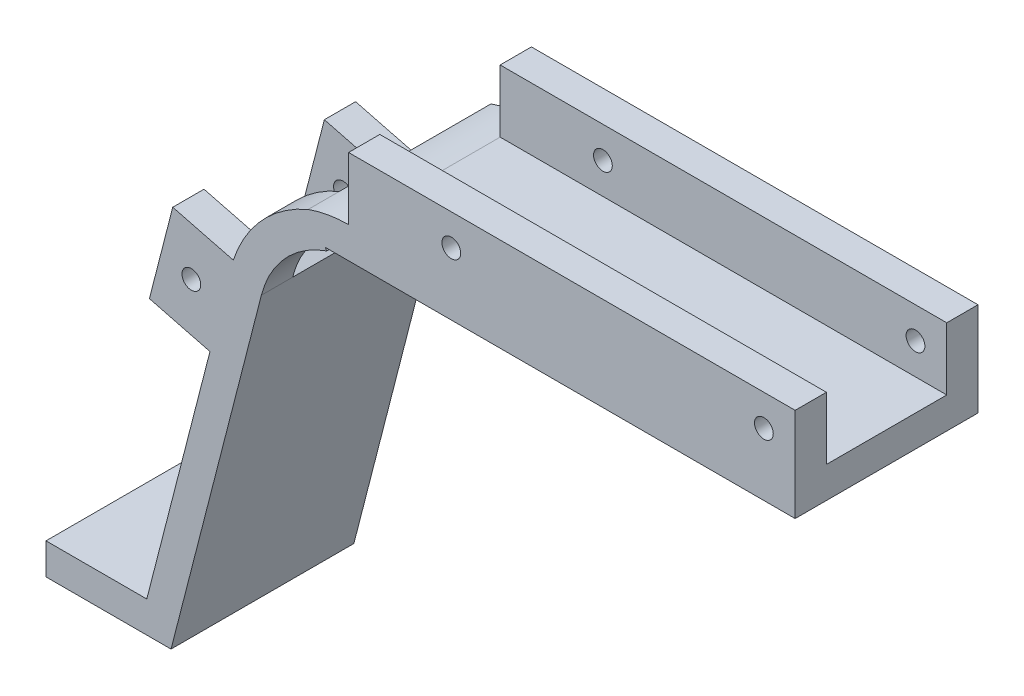
ISO-10303-21;
HEADER;
FILE_DESCRIPTION(('STEP AP214'),'2;1');
FILE_NAME('part.step','',(''),(''),'','','');
FILE_SCHEMA(('AUTOMOTIVE_DESIGN { 1 0 10303 214 1 1 1 1 }'));
ENDSEC;
DATA;
#1=APPLICATION_CONTEXT('core data for automotive mechanical design processes');
#2=APPLICATION_PROTOCOL_DEFINITION('international standard','automotive_design',2000,#1);
#3=PRODUCT_CONTEXT('',#1,'mechanical');
#4=PRODUCT('Part','Part','',(#3));
#5=PRODUCT_RELATED_PRODUCT_CATEGORY('part','',(#4));
#6=PRODUCT_DEFINITION_FORMATION('','',#4);
#7=PRODUCT_DEFINITION_CONTEXT('part definition',#1,'design');
#8=PRODUCT_DEFINITION('design','',#6,#7);
#9=PRODUCT_DEFINITION_SHAPE('','',#8);
#10=(LENGTH_UNIT() NAMED_UNIT(*) SI_UNIT(.MILLI.,.METRE.));
#11=(NAMED_UNIT(*) PLANE_ANGLE_UNIT() SI_UNIT($,.RADIAN.));
#12=(NAMED_UNIT(*) SI_UNIT($,.STERADIAN.) SOLID_ANGLE_UNIT());
#13=UNCERTAINTY_MEASURE_WITH_UNIT(LENGTH_MEASURE(1.E-05),#10,'distance_accuracy_value','');
#14=(GEOMETRIC_REPRESENTATION_CONTEXT(3) GLOBAL_UNCERTAINTY_ASSIGNED_CONTEXT((#13)) GLOBAL_UNIT_ASSIGNED_CONTEXT((#10,
#11,#12)) REPRESENTATION_CONTEXT('',''));
#15=CARTESIAN_POINT('',(0.,0.,0.));
#16=DIRECTION('',(0.,0.,1.));
#17=DIRECTION('',(1.,0.,0.));
#18=AXIS2_PLACEMENT_3D('',#15,#16,#17);
#19=CARTESIAN_POINT('',(30.0716443930858,58.6603082817505,-5.));
#20=DIRECTION('',(0.968542433750036,-0.248848455943689,0.));
#21=DIRECTION('',(0.248848455943689,0.968542433750036,0.));
#22=AXIS2_PLACEMENT_3D('',#19,#20,#21);
#23=PLANE('',#22);
#24=DIRECTION('',(0.,0.,1.));
#25=VECTOR('',#24,1.);
#26=CARTESIAN_POINT('',(26.3912089750386,44.3356950807672,-29.25));
#27=LINE('',#26,#25);
#28=CARTESIAN_POINT('',(26.3912089750386,44.3356950807672,-29.25));
#29=VERTEX_POINT('',#28);
#30=CARTESIAN_POINT('',(26.3912089750386,44.3356950807672,-24.25));
#31=VERTEX_POINT('',#30);
#32=EDGE_CURVE('E847',#29,#31,#27,.T.);
#33=ORIENTED_EDGE('',*,*,#32,.F.);
#34=DIRECTION('',(0.248848455943689,0.968542433750035,0.));
#35=VECTOR('',#34,1.);
#36=CARTESIAN_POINT('',(15.,0.,-29.25));
#37=LINE('',#36,#35);
#38=CARTESIAN_POINT('',(16.2846543799851,5.,-29.25));
#39=VERTEX_POINT('',#38);
#40=EDGE_CURVE('E237',#39,#29,#37,.T.);
#41=ORIENTED_EDGE('',*,*,#40,.F.);
#42=DIRECTION('',(0.,0.,1.));
#43=VECTOR('',#42,1.);
#44=CARTESIAN_POINT('',(16.2846543799851,5.,-5.));
#45=LINE('',#44,#43);
#46=CARTESIAN_POINT('',(16.2846543799851,5.,0.));
#47=VERTEX_POINT('',#46);
#48=EDGE_CURVE('E388',#39,#47,#45,.T.);
#49=ORIENTED_EDGE('',*,*,#48,.T.);
#50=DIRECTION('',(0.248848455943689,0.968542433750035,0.));
#51=VECTOR('',#50,1.);
#52=CARTESIAN_POINT('',(15.,0.,0.));
#53=LINE('',#52,#51);
#54=CARTESIAN_POINT('',(26.3912089750386,44.3356950807672,0.));
#55=VERTEX_POINT('',#54);
#56=EDGE_CURVE('E403',#47,#55,#53,.T.);
#57=ORIENTED_EDGE('',*,*,#56,.T.);
#58=DIRECTION('',(0.,0.,1.));
#59=VECTOR('',#58,1.);
#60=CARTESIAN_POINT('',(26.3912089750386,44.3356950807672,-5.));
#61=LINE('',#60,#59);
#62=CARTESIAN_POINT('',(26.3912089750386,44.3356950807672,-5.));
#63=VERTEX_POINT('',#62);
#64=EDGE_CURVE('E51',#63,#55,#61,.T.);
#65=ORIENTED_EDGE('',*,*,#64,.F.);
#66=DIRECTION('',(-0.248848455943689,-0.968542433750035,0.));
#67=VECTOR('',#66,1.);
#68=CARTESIAN_POINT('',(30.1238545546568,58.8635153169826,-5.));
#69=LINE('',#68,#67);
#70=CARTESIAN_POINT('',(30.1238545546567,58.8635153169826,-5.));
#71=VERTEX_POINT('',#70);
#72=EDGE_CURVE('E56',#71,#63,#69,.T.);
#73=ORIENTED_EDGE('',*,*,#72,.F.);
#74=DIRECTION('',(0.,0.,-1.));
#75=VECTOR('',#74,1.);
#76=CARTESIAN_POINT('',(30.1238545546568,58.8635153169826,-5.));
#77=LINE('',#76,#75);
#78=CARTESIAN_POINT('',(30.1238545546568,58.8635153169826,0.));
#79=VERTEX_POINT('',#78);
#80=EDGE_CURVE('E248',#79,#71,#77,.T.);
#81=ORIENTED_EDGE('',*,*,#80,.F.);
#82=CARTESIAN_POINT('',(30.1239358141939,58.8638315870177,0.));
#83=VERTEX_POINT('',#82);
#84=EDGE_CURVE('E392',#79,#83,#53,.T.);
#85=ORIENTED_EDGE('',*,*,#84,.T.);
#86=DIRECTION('',(0.,0.,1.));
#87=VECTOR('',#86,1.);
#88=CARTESIAN_POINT('',(30.1239358141939,58.8638315870177,-29.25));
#89=LINE('',#88,#87);
#90=CARTESIAN_POINT('',(30.1239358141939,58.8638315870177,-24.25));
#91=VERTEX_POINT('',#90);
#92=EDGE_CURVE('E415',#91,#83,#89,.T.);
#93=ORIENTED_EDGE('',*,*,#92,.F.);
#94=DIRECTION('',(0.248848455943689,0.968542433750036,0.));
#95=VECTOR('',#94,1.);
#96=CARTESIAN_POINT('',(30.1239358141939,58.8638315870177,-24.25));
#97=LINE('',#96,#95);
#98=EDGE_CURVE('E232',#31,#91,#97,.T.);
#99=ORIENTED_EDGE('',*,*,#98,.F.);
#100=EDGE_LOOP('',(#33,#41,#49,#57,#65,#73,#81,#85,#93,#99));
#101=FACE_BOUND('',#100,.T.);
#102=ADVANCED_FACE('F34',(#101),#23,.F.);
#103=CARTESIAN_POINT('',(120.,73.,-5.));
#104=DIRECTION('',(0.,-1.,0.));
#105=DIRECTION('',(1.,0.,0.));
#106=AXIS2_PLACEMENT_3D('',#103,#104,#105);
#107=PLANE('',#106);
#108=DIRECTION('',(1.,0.,0.));
#109=VECTOR('',#108,1.);
#110=CARTESIAN_POINT('',(48.5613886077065,73.,-24.25));
#111=LINE('',#110,#109);
#112=CARTESIAN_POINT('',(48.5613886077065,73.,-24.25));
#113=VERTEX_POINT('',#112);
#114=CARTESIAN_POINT('',(120.,73.,-24.25));
#115=VERTEX_POINT('',#114);
#116=EDGE_CURVE('E287',#113,#115,#111,.T.);
#117=ORIENTED_EDGE('',*,*,#116,.F.);
#118=DIRECTION('',(0.,0.,1.));
#119=VECTOR('',#118,1.);
#120=CARTESIAN_POINT('',(48.5613886077065,73.,-5.));
#121=LINE('',#120,#119);
#122=CARTESIAN_POINT('',(48.5613886077065,73.,-5.));
#123=VERTEX_POINT('',#122);
#124=EDGE_CURVE('E441',#113,#123,#121,.T.);
#125=ORIENTED_EDGE('',*,*,#124,.T.);
#126=DIRECTION('',(-1.,0.,0.));
#127=VECTOR('',#126,1.);
#128=CARTESIAN_POINT('',(48.5613886077065,73.,-5.));
#129=LINE('',#128,#127);
#130=CARTESIAN_POINT('',(120.,73.,-5.));
#131=VERTEX_POINT('',#130);
#132=EDGE_CURVE('E311',#131,#123,#129,.T.);
#133=ORIENTED_EDGE('',*,*,#132,.F.);
#134=DIRECTION('',(0.,0.,1.));
#135=VECTOR('',#134,1.);
#136=CARTESIAN_POINT('',(120.,73.,-5.));
#137=LINE('',#136,#135);
#138=EDGE_CURVE('E11',#115,#131,#137,.T.);
#139=ORIENTED_EDGE('',*,*,#138,.F.);
#140=EDGE_LOOP('',(#117,#125,#133,#139));
#141=FACE_BOUND('',#140,.T.);
#142=ADVANCED_FACE('F473',(#141),#107,.F.);
#143=CARTESIAN_POINT('',(44.7991427530738,68.,-29.25));
#144=DIRECTION('',(0.819152044288991,0.573576436351047,0.));
#145=DIRECTION('',(-0.573576436351047,0.819152044288991,0.));
#146=AXIS2_PLACEMENT_3D('',#143,#144,#145);
#147=PLANE('',#146);
#148=DIRECTION('',(0.573576436351047,-0.819152044288991,0.));
#149=VECTOR('',#148,1.);
#150=CARTESIAN_POINT('',(45.0696556216259,67.6136675859792,-5.));
#151=LINE('',#150,#149);
#152=CARTESIAN_POINT('',(42.0896554210916,71.8695489324633,-5.));
#153=VERTEX_POINT('',#152);
#154=CARTESIAN_POINT('',(44.7991427530738,68.,-5.));
#155=VERTEX_POINT('',#154);
#156=EDGE_CURVE('E358',#153,#155,#151,.T.);
#157=ORIENTED_EDGE('',*,*,#156,.F.);
#158=DIRECTION('',(0.,0.,1.));
#159=VECTOR('',#158,1.);
#160=CARTESIAN_POINT('',(42.0896554210916,71.8695489324633,-29.25));
#161=LINE('',#160,#159);
#162=CARTESIAN_POINT('',(42.0896554210916,71.8695489324633,-29.25));
#163=VERTEX_POINT('',#162);
#164=EDGE_CURVE('E430',#163,#153,#161,.T.);
#165=ORIENTED_EDGE('',*,*,#164,.F.);
#166=DIRECTION('',(-0.573576436351047,0.819152044288991,0.));
#167=VECTOR('',#166,1.);
#168=CARTESIAN_POINT('',(44.7991427530738,68.,-29.25));
#169=LINE('',#168,#167);
#170=CARTESIAN_POINT('',(44.7991427530738,68.,-29.25));
#171=VERTEX_POINT('',#170);
#172=EDGE_CURVE('E425',#171,#163,#169,.T.);
#173=ORIENTED_EDGE('',*,*,#172,.F.);
#174=DIRECTION('',(0.,0.,1.));
#175=VECTOR('',#174,1.);
#176=CARTESIAN_POINT('',(44.7991427530738,68.,-29.25));
#177=LINE('',#176,#175);
#178=EDGE_CURVE('E436',#171,#155,#177,.T.);
#179=ORIENTED_EDGE('',*,*,#178,.T.);
#180=EDGE_LOOP('',(#157,#165,#173,#179));
#181=FACE_BOUND('',#180,.T.);
#182=ADVANCED_FACE('F478',(#181),#147,.F.);
#183=CARTESIAN_POINT('',(34.6142500871605,56.2480223657393,-29.25));
#184=DIRECTION('',(-0.503362570604781,-0.864075299099649,0.));
#185=DIRECTION('',(0.864075299099649,-0.503362570604781,0.));
#186=AXIS2_PLACEMENT_3D('',#183,#184,#185);
#187=PLANE('',#186);
#188=DIRECTION('',(0.,0.,1.));
#189=VECTOR('',#188,1.);
#190=CARTESIAN_POINT('',(30.1249712371178,58.8632284067797,-5.));
#191=LINE('',#190,#189);
#192=CARTESIAN_POINT('',(30.1249712371178,58.8632284067797,-5.));
#193=VERTEX_POINT('',#192);
#194=CARTESIAN_POINT('',(30.1249712371178,58.8632284067797,0.));
#195=VERTEX_POINT('',#194);
#196=EDGE_CURVE('E374',#193,#195,#191,.T.);
#197=ORIENTED_EDGE('',*,*,#196,.F.);
#198=DIRECTION('',(-0.864075299099649,0.503362570604781,0.));
#199=VECTOR('',#198,1.);
#200=CARTESIAN_POINT('',(30.1249712371178,58.8632284067797,-5.));
#201=LINE('',#200,#199);
#202=CARTESIAN_POINT('',(34.6142500871605,56.2480223657393,-5.));
#203=VERTEX_POINT('',#202);
#204=EDGE_CURVE('E352',#203,#193,#201,.T.);
#205=ORIENTED_EDGE('',*,*,#204,.F.);
#206=DIRECTION('',(0.,0.,1.));
#207=VECTOR('',#206,1.);
#208=CARTESIAN_POINT('',(34.6142500871605,56.2480223657393,-29.25));
#209=LINE('',#208,#207);
#210=CARTESIAN_POINT('',(34.6142500871605,56.2480223657393,-29.25));
#211=VERTEX_POINT('',#210);
#212=EDGE_CURVE('E412',#211,#203,#209,.T.);
#213=ORIENTED_EDGE('',*,*,#212,.F.);
#214=DIRECTION('',(0.864075299099649,-0.503362570604781,0.));
#215=VECTOR('',#214,1.);
#216=CARTESIAN_POINT('',(34.6142500871605,56.2480223657393,-29.25));
#217=LINE('',#216,#215);
#218=CARTESIAN_POINT('',(30.1239358141939,58.8638315870177,-29.25));
#219=VERTEX_POINT('',#218);
#220=EDGE_CURVE('E398',#219,#211,#217,.T.);
#221=ORIENTED_EDGE('',*,*,#220,.F.);
#222=EDGE_CURVE('E416',#219,#91,#89,.T.);
#223=ORIENTED_EDGE('',*,*,#222,.T.);
#224=ORIENTED_EDGE('',*,*,#92,.T.);
#225=DIRECTION('',(0.864075299099649,-0.503362570604781,0.));
#226=VECTOR('',#225,1.);
#227=CARTESIAN_POINT('',(34.6142500871605,56.2480223657393,0.));
#228=LINE('',#227,#226);
#229=EDGE_CURVE('E405',#83,#195,#228,.T.);
#230=ORIENTED_EDGE('',*,*,#229,.T.);
#231=EDGE_LOOP('',(#197,#205,#213,#221,#223,#224,#230));
#232=FACE_BOUND('',#231,.T.);
#233=ADVANCED_FACE('F492',(#232),#187,.F.);
#234=CARTESIAN_POINT('',(0.,0.,5.));
#235=DIRECTION('',(0.,1.,0.));
#236=DIRECTION('',(0.,0.,1.));
#237=AXIS2_PLACEMENT_3D('',#234,#235,#236);
#238=PLANE('',#237);
#239=CARTESIAN_POINT('',(7.66239642763076,0.,-14.625));
#240=DIRECTION('',(0.,1.,0.));
#241=DIRECTION('',(-1.,0.,0.));
#242=AXIS2_PLACEMENT_3D('',#239,#240,#241);
#243=CIRCLE('',#242,1.5);
#244=CARTESIAN_POINT('',(6.16239642763076,0.,-14.625));
#245=VERTEX_POINT('',#244);
#246=EDGE_CURVE('E332',#245,#245,#243,.T.);
#247=ORIENTED_EDGE('',*,*,#246,.T.);
#248=EDGE_LOOP('',(#247));
#249=FACE_BOUND('',#248,.T.);
#250=DIRECTION('',(0.,0.,1.));
#251=VECTOR('',#250,1.);
#252=CARTESIAN_POINT('',(20.1623964276308,0.,-29.25));
#253=LINE('',#252,#251);
#254=CARTESIAN_POINT('',(20.1623964276308,0.,-29.25));
#255=VERTEX_POINT('',#254);
#256=CARTESIAN_POINT('',(20.1623964276307,0.,0.));
#257=VERTEX_POINT('',#256);
#258=EDGE_CURVE('E402',#255,#257,#253,.T.);
#259=ORIENTED_EDGE('',*,*,#258,.T.);
#260=DIRECTION('',(1.,0.,0.));
#261=VECTOR('',#260,1.);
#262=CARTESIAN_POINT('',(0.162396427630759,0.,0.));
#263=LINE('',#262,#261);
#264=CARTESIAN_POINT('',(0.162396427630759,0.,0.));
#265=VERTEX_POINT('',#264);
#266=EDGE_CURVE('E340',#265,#257,#263,.T.);
#267=ORIENTED_EDGE('',*,*,#266,.F.);
#268=DIRECTION('',(0.,0.,-1.));
#269=VECTOR('',#268,1.);
#270=CARTESIAN_POINT('',(0.162396427630756,0.,5.));
#271=LINE('',#270,#269);
#272=CARTESIAN_POINT('',(0.162396427630756,0.,-29.25));
#273=VERTEX_POINT('',#272);
#274=EDGE_CURVE('E385',#265,#273,#271,.T.);
#275=ORIENTED_EDGE('',*,*,#274,.T.);
#276=DIRECTION('',(-1.,0.,0.));
#277=VECTOR('',#276,1.);
#278=CARTESIAN_POINT('',(20.1623964276308,0.,-29.25));
#279=LINE('',#278,#277);
#280=EDGE_CURVE('E393',#255,#273,#279,.T.);
#281=ORIENTED_EDGE('',*,*,#280,.F.);
#282=EDGE_LOOP('',(#259,#267,#275,#281));
#283=FACE_BOUND('',#282,.T.);
#284=ADVANCED_FACE('F36',(#249,#283),#238,.F.);
#285=CARTESIAN_POINT('',(120.,0.,5.));
#286=DIRECTION('',(-1.,0.,0.));
#287=DIRECTION('',(0.,-1.,0.));
#288=AXIS2_PLACEMENT_3D('',#285,#286,#287);
#289=PLANE('',#288);
#290=DIRECTION('',(0.,-1.,0.));
#291=VECTOR('',#290,1.);
#292=CARTESIAN_POINT('',(120.,73.,-29.25));
#293=LINE('',#292,#291);
#294=CARTESIAN_POINT('',(120.,83.,-29.25));
#295=VERTEX_POINT('',#294);
#296=CARTESIAN_POINT('',(120.,68.,-29.25));
#297=VERTEX_POINT('',#296);
#298=EDGE_CURVE('E420',#295,#297,#293,.T.);
#299=ORIENTED_EDGE('',*,*,#298,.F.);
#300=DIRECTION('',(0.,0.,-1.));
#301=VECTOR('',#300,1.);
#302=CARTESIAN_POINT('',(120.,83.,-29.25));
#303=LINE('',#302,#301);
#304=CARTESIAN_POINT('',(120.,83.,-24.25));
#305=VERTEX_POINT('',#304);
#306=EDGE_CURVE('E293',#305,#295,#303,.T.);
#307=ORIENTED_EDGE('',*,*,#306,.F.);
#308=DIRECTION('',(0.,-1.,0.));
#309=VECTOR('',#308,1.);
#310=CARTESIAN_POINT('',(120.,83.,-24.25));
#311=LINE('',#310,#309);
#312=EDGE_CURVE('E301',#305,#115,#311,.T.);
#313=ORIENTED_EDGE('',*,*,#312,.T.);
#314=ORIENTED_EDGE('',*,*,#138,.T.);
#315=DIRECTION('',(0.,-1.,0.));
#316=VECTOR('',#315,1.);
#317=CARTESIAN_POINT('',(120.,83.,-5.));
#318=LINE('',#317,#316);
#319=CARTESIAN_POINT('',(120.,83.,-5.));
#320=VERTEX_POINT('',#319);
#321=EDGE_CURVE('E325',#320,#131,#318,.T.);
#322=ORIENTED_EDGE('',*,*,#321,.F.);
#323=DIRECTION('',(0.,0.,-1.));
#324=VECTOR('',#323,1.);
#325=CARTESIAN_POINT('',(120.,83.,0.));
#326=LINE('',#325,#324);
#327=CARTESIAN_POINT('',(120.,83.,0.));
#328=VERTEX_POINT('',#327);
#329=EDGE_CURVE('E314',#328,#320,#326,.T.);
#330=ORIENTED_EDGE('',*,*,#329,.F.);
#331=DIRECTION('',(0.,-1.,0.));
#332=VECTOR('',#331,1.);
#333=CARTESIAN_POINT('',(120.,0.,0.));
#334=LINE('',#333,#332);
#335=CARTESIAN_POINT('',(120.,68.,0.));
#336=VERTEX_POINT('',#335);
#337=EDGE_CURVE('E345',#328,#336,#334,.T.);
#338=ORIENTED_EDGE('',*,*,#337,.T.);
#339=DIRECTION('',(0.,0.,1.));
#340=VECTOR('',#339,1.);
#341=CARTESIAN_POINT('',(120.,68.,-29.25));
#342=LINE('',#341,#340);
#343=EDGE_CURVE('E439',#297,#336,#342,.T.);
#344=ORIENTED_EDGE('',*,*,#343,.F.);
#345=EDGE_LOOP('',(#299,#307,#313,#314,#322,#330,#338,#344));
#346=FACE_BOUND('',#345,.T.);
#347=ADVANCED_FACE('F483',(#346),#289,.F.);
#348=CARTESIAN_POINT('',(48.5613886077065,53.9097221037271,-5.));
#349=DIRECTION('',(0.,0.,1.));
#350=DIRECTION('',(1.,0.,0.));
#351=AXIS2_PLACEMENT_3D('',#348,#349,#350);
#352=CYLINDRICAL_SURFACE('',#351,19.0902778962729);
#353=DIRECTION('',(0.,0.,1.));
#354=VECTOR('',#353,1.);
#355=CARTESIAN_POINT('',(42.0896554210916,71.8695489324633,-5.));
#356=LINE('',#355,#354);
#357=CARTESIAN_POINT('',(42.0896554210916,71.8695489324633,0.));
#358=VERTEX_POINT('',#357);
#359=EDGE_CURVE('E371',#153,#358,#356,.T.);
#360=ORIENTED_EDGE('',*,*,#359,.T.);
#361=CARTESIAN_POINT('',(48.5613886077065,53.9097221037271,0.));
#362=DIRECTION('',(0.,0.,-1.));
#363=DIRECTION('',(-1.,0.,0.));
#364=AXIS2_PLACEMENT_3D('',#361,#362,#363);
#365=CIRCLE('',#364,19.0902778962729);
#366=CARTESIAN_POINT('',(48.5613886077065,73.,0.));
#367=VERTEX_POINT('',#366);
#368=EDGE_CURVE('E342',#358,#367,#365,.T.);
#369=ORIENTED_EDGE('',*,*,#368,.T.);
#370=DIRECTION('',(0.,0.,1.));
#371=VECTOR('',#370,1.);
#372=CARTESIAN_POINT('',(48.5613886077065,73.,0.));
#373=LINE('',#372,#371);
#374=EDGE_CURVE('E306',#123,#367,#373,.T.);
#375=ORIENTED_EDGE('',*,*,#374,.F.);
#376=ORIENTED_EDGE('',*,*,#124,.F.);
#377=CARTESIAN_POINT('',(48.5613886077065,73.,-29.25));
#378=VERTEX_POINT('',#377);
#379=EDGE_CURVE('E43',#378,#113,#121,.T.);
#380=ORIENTED_EDGE('',*,*,#379,.F.);
#381=CARTESIAN_POINT('',(48.5613886077065,53.9097221037271,-29.25));
#382=DIRECTION('',(0.,0.,-1.));
#383=DIRECTION('',(1.,0.,0.));
#384=AXIS2_PLACEMENT_3D('',#381,#382,#383);
#385=CIRCLE('',#384,19.0902778962729);
#386=EDGE_CURVE('E427',#163,#378,#385,.T.);
#387=ORIENTED_EDGE('',*,*,#386,.F.);
#388=ORIENTED_EDGE('',*,*,#164,.T.);
#389=EDGE_LOOP('',(#360,#369,#375,#376,#380,#387,#388));
#390=FACE_BOUND('',#389,.T.);
#391=ADVANCED_FACE('F482',(#390),#352,.T.);
#392=CARTESIAN_POINT('',(120.,68.,-29.25));
#393=DIRECTION('',(0.,1.,0.));
#394=DIRECTION('',(0.,0.,1.));
#395=AXIS2_PLACEMENT_3D('',#392,#393,#394);
#396=PLANE('',#395);
#397=DIRECTION('',(-1.,0.,0.));
#398=VECTOR('',#397,1.);
#399=CARTESIAN_POINT('',(120.,68.,0.));
#400=LINE('',#399,#398);
#401=CARTESIAN_POINT('',(44.7991427530738,68.,0.));
#402=VERTEX_POINT('',#401);
#403=EDGE_CURVE('E419',#336,#402,#400,.T.);
#404=ORIENTED_EDGE('',*,*,#403,.T.);
#405=EDGE_CURVE('E435',#155,#402,#177,.T.);
#406=ORIENTED_EDGE('',*,*,#405,.F.);
#407=ORIENTED_EDGE('',*,*,#178,.F.);
#408=DIRECTION('',(-1.,0.,0.));
#409=VECTOR('',#408,1.);
#410=CARTESIAN_POINT('',(120.,68.,-29.25));
#411=LINE('',#410,#409);
#412=EDGE_CURVE('E423',#297,#171,#411,.T.);
#413=ORIENTED_EDGE('',*,*,#412,.F.);
#414=ORIENTED_EDGE('',*,*,#343,.T.);
#415=EDGE_LOOP('',(#404,#406,#407,#413,#414));
#416=FACE_BOUND('',#415,.T.);
#417=ADVANCED_FACE('F490',(#416),#396,.F.);
#418=CARTESIAN_POINT('',(48.5613886077065,53.9097221037271,-29.25));
#419=DIRECTION('',(0.,0.,1.));
#420=DIRECTION('',(1.,0.,0.));
#421=AXIS2_PLACEMENT_3D('',#418,#419,#420);
#422=PLANE('',#421);
#423=CARTESIAN_POINT('',(65.,78.,-29.25));
#424=DIRECTION('',(0.,0.,1.));
#425=DIRECTION('',(1.,0.,0.));
#426=AXIS2_PLACEMENT_3D('',#423,#424,#425);
#427=CIRCLE('',#426,1.5);
#428=CARTESIAN_POINT('',(66.5,78.,-29.25));
#429=VERTEX_POINT('',#428);
#430=EDGE_CURVE('E268',#429,#429,#427,.T.);
#431=ORIENTED_EDGE('',*,*,#430,.T.);
#432=EDGE_LOOP('',(#431));
#433=FACE_BOUND('',#432,.T.);
#434=CARTESIAN_POINT('',(115.,78.,-29.25));
#435=DIRECTION('',(0.,0.,1.));
#436=DIRECTION('',(1.,0.,0.));
#437=AXIS2_PLACEMENT_3D('',#434,#435,#436);
#438=CIRCLE('',#437,1.5);
#439=CARTESIAN_POINT('',(116.5,78.,-29.25));
#440=VERTEX_POINT('',#439);
#441=EDGE_CURVE('E275',#440,#440,#438,.T.);
#442=ORIENTED_EDGE('',*,*,#441,.T.);
#443=EDGE_LOOP('',(#442));
#444=FACE_BOUND('',#443,.T.);
#445=ORIENTED_EDGE('',*,*,#298,.T.);
#446=ORIENTED_EDGE('',*,*,#412,.T.);
#447=ORIENTED_EDGE('',*,*,#172,.T.);
#448=ORIENTED_EDGE('',*,*,#386,.T.);
#449=DIRECTION('',(0.,-1.,0.));
#450=VECTOR('',#449,1.);
#451=CARTESIAN_POINT('',(48.5613886077065,83.,-29.25));
#452=LINE('',#451,#450);
#453=CARTESIAN_POINT('',(48.5613886077065,83.,-29.25));
#454=VERTEX_POINT('',#453);
#455=EDGE_CURVE('E298',#454,#378,#452,.T.);
#456=ORIENTED_EDGE('',*,*,#455,.F.);
#457=DIRECTION('',(-1.,0.,0.));
#458=VECTOR('',#457,1.);
#459=CARTESIAN_POINT('',(48.5613886077065,83.,-29.25));
#460=LINE('',#459,#458);
#461=EDGE_CURVE('E296',#295,#454,#460,.T.);
#462=ORIENTED_EDGE('',*,*,#461,.F.);
#463=EDGE_LOOP('',(#445,#446,#447,#448,#456,#462));
#464=FACE_BOUND('',#463,.T.);
#465=ADVANCED_FACE('F501',(#433,#444,#464),#422,.F.);
#466=CARTESIAN_POINT('',(0.,0.,0.));
#467=DIRECTION('',(0.,0.,-1.));
#468=DIRECTION('',(-1.,0.,0.));
#469=AXIS2_PLACEMENT_3D('',#466,#467,#468);
#470=PLANE('',#469);
#471=CARTESIAN_POINT('',(23.4148602258661,52.8440056136109,0.));
#472=DIRECTION('',(0.,0.,1.));
#473=DIRECTION('',(1.,0.,0.));
#474=AXIS2_PLACEMENT_3D('',#471,#472,#473);
#475=CIRCLE('',#474,1.5);
#476=CARTESIAN_POINT('',(24.9148602258661,52.8440056136109,0.));
#477=VERTEX_POINT('',#476);
#478=EDGE_CURVE('E852',#477,#477,#475,.T.);
#479=ORIENTED_EDGE('',*,*,#478,.F.);
#480=EDGE_LOOP('',(#479));
#481=FACE_BOUND('',#480,.T.);
#482=CARTESIAN_POINT('',(65.,78.,0.));
#483=DIRECTION('',(0.,0.,1.));
#484=DIRECTION('',(1.,0.,0.));
#485=AXIS2_PLACEMENT_3D('',#482,#483,#484);
#486=CIRCLE('',#485,1.5);
#487=CARTESIAN_POINT('',(66.5,78.,0.));
#488=VERTEX_POINT('',#487);
#489=EDGE_CURVE('E272',#488,#488,#486,.T.);
#490=ORIENTED_EDGE('',*,*,#489,.F.);
#491=EDGE_LOOP('',(#490));
#492=FACE_BOUND('',#491,.T.);
#493=CARTESIAN_POINT('',(115.,78.,0.));
#494=DIRECTION('',(0.,0.,1.));
#495=DIRECTION('',(1.,0.,0.));
#496=AXIS2_PLACEMENT_3D('',#493,#494,#495);
#497=CIRCLE('',#496,1.5);
#498=CARTESIAN_POINT('',(116.5,78.,0.));
#499=VERTEX_POINT('',#498);
#500=EDGE_CURVE('E267',#499,#499,#497,.T.);
#501=ORIENTED_EDGE('',*,*,#500,.F.);
#502=EDGE_LOOP('',(#501));
#503=FACE_BOUND('',#502,.T.);
#504=ORIENTED_EDGE('',*,*,#56,.F.);
#505=DIRECTION('',(-1.,0.,0.));
#506=VECTOR('',#505,1.);
#507=CARTESIAN_POINT('',(20.1623964276308,5.,0.));
#508=LINE('',#507,#506);
#509=CARTESIAN_POINT('',(0.162396427630758,5.,0.));
#510=VERTEX_POINT('',#509);
#511=EDGE_CURVE('E344',#47,#510,#508,.T.);
#512=ORIENTED_EDGE('',*,*,#511,.T.);
#513=DIRECTION('',(0.,1.,0.));
#514=VECTOR('',#513,1.);
#515=CARTESIAN_POINT('',(0.162396427630759,0.,0.));
#516=LINE('',#515,#514);
#517=EDGE_CURVE('E335',#265,#510,#516,.T.);
#518=ORIENTED_EDGE('',*,*,#517,.F.);
#519=ORIENTED_EDGE('',*,*,#266,.T.);
#520=DIRECTION('',(-0.248848455943689,-0.968542433750035,0.));
#521=VECTOR('',#520,1.);
#522=CARTESIAN_POINT('',(34.6142500871605,56.2480223657393,0.));
#523=LINE('',#522,#521);
#524=CARTESIAN_POINT('',(34.6142500871605,56.2480223657393,0.));
#525=VERTEX_POINT('',#524);
#526=EDGE_CURVE('E396',#525,#257,#523,.T.);
#527=ORIENTED_EDGE('',*,*,#526,.F.);
#528=CARTESIAN_POINT('',(50.4012958336855,52.2171674074793,0.));
#529=DIRECTION('',(0.,0.,1.));
#530=DIRECTION('',(1.,0.,0.));
#531=AXIS2_PLACEMENT_3D('',#528,#529,#530);
#532=CIRCLE('',#531,16.2935142034308);
#533=CARTESIAN_POINT('',(45.0696556216259,67.6136675859792,0.));
#534=VERTEX_POINT('',#533);
#535=EDGE_CURVE('E348',#534,#525,#532,.T.);
#536=ORIENTED_EDGE('',*,*,#535,.F.);
#537=DIRECTION('',(0.573576436351047,-0.819152044288991,0.));
#538=VECTOR('',#537,1.);
#539=CARTESIAN_POINT('',(45.0696556216259,67.6136675859792,0.));
#540=LINE('',#539,#538);
#541=EDGE_CURVE('E353',#402,#534,#540,.T.);
#542=ORIENTED_EDGE('',*,*,#541,.F.);
#543=ORIENTED_EDGE('',*,*,#403,.F.);
#544=ORIENTED_EDGE('',*,*,#337,.F.);
#545=DIRECTION('',(1.,0.,0.));
#546=VECTOR('',#545,1.);
#547=CARTESIAN_POINT('',(48.5613886077065,83.,0.));
#548=LINE('',#547,#546);
#549=CARTESIAN_POINT('',(48.5613886077065,83.,0.));
#550=VERTEX_POINT('',#549);
#551=EDGE_CURVE('E310',#550,#328,#548,.T.);
#552=ORIENTED_EDGE('',*,*,#551,.F.);
#553=DIRECTION('',(0.,-1.,0.));
#554=VECTOR('',#553,1.);
#555=CARTESIAN_POINT('',(48.5613886077065,83.,0.));
#556=LINE('',#555,#554);
#557=EDGE_CURVE('E328',#550,#367,#556,.T.);
#558=ORIENTED_EDGE('',*,*,#557,.T.);
#559=ORIENTED_EDGE('',*,*,#368,.F.);
#560=CARTESIAN_POINT('',(50.4012958336855,52.2171674074793,0.));
#561=DIRECTION('',(0.,0.,-1.));
#562=DIRECTION('',(1.,0.,0.));
#563=AXIS2_PLACEMENT_3D('',#560,#561,#562);
#564=CIRCLE('',#563,21.337747443247);
#565=EDGE_CURVE('E364',#195,#358,#564,.T.);
#566=ORIENTED_EDGE('',*,*,#565,.F.);
#567=ORIENTED_EDGE('',*,*,#229,.F.);
#568=ORIENTED_EDGE('',*,*,#84,.F.);
#569=DIRECTION('',(0.968542433750036,-0.248848455943689,0.));
#570=VECTOR('',#569,1.);
#571=CARTESIAN_POINT('',(20.4384302171564,61.3519998764195,0.));
#572=LINE('',#571,#570);
#573=CARTESIAN_POINT('',(20.4384302171564,61.3519998764195,0.));
#574=VERTEX_POINT('',#573);
#575=EDGE_CURVE('E259',#574,#79,#572,.T.);
#576=ORIENTED_EDGE('',*,*,#575,.F.);
#577=DIRECTION('',(0.248848455943689,0.968542433750035,0.));
#578=VECTOR('',#577,1.);
#579=CARTESIAN_POINT('',(20.4384302171564,61.3519998764195,0.));
#580=LINE('',#579,#578);
#581=CARTESIAN_POINT('',(16.7057846375382,46.8241796402041,0.));
#582=VERTEX_POINT('',#581);
#583=EDGE_CURVE('E250',#582,#574,#580,.T.);
#584=ORIENTED_EDGE('',*,*,#583,.F.);
#585=DIRECTION('',(0.968542433750036,-0.248848455943689,0.));
#586=VECTOR('',#585,1.);
#587=CARTESIAN_POINT('',(16.7057846375382,46.8241796402041,0.));
#588=LINE('',#587,#586);
#589=EDGE_CURVE('E262',#582,#55,#588,.T.);
#590=ORIENTED_EDGE('',*,*,#589,.T.);
#591=EDGE_LOOP('',(#504,#512,#518,#519,#527,#536,#542,#543,#544,#552,#558,#559,#566,#567,#568,
#576,#584,#590));
#592=FACE_BOUND('',#591,.T.);
#593=ADVANCED_FACE('F525',(#481,#492,#503,#592),#470,.F.);
#594=CARTESIAN_POINT('',(34.6142500871605,56.2480223657393,-29.25));
#595=DIRECTION('',(-0.968542433750035,0.248848455943689,0.));
#596=DIRECTION('',(-0.248848455943689,-0.968542433750035,0.));
#597=AXIS2_PLACEMENT_3D('',#594,#595,#596);
#598=PLANE('',#597);
#599=ORIENTED_EDGE('',*,*,#526,.T.);
#600=ORIENTED_EDGE('',*,*,#258,.F.);
#601=DIRECTION('',(-0.248848455943689,-0.968542433750035,0.));
#602=VECTOR('',#601,1.);
#603=CARTESIAN_POINT('',(34.6142500871605,56.2480223657393,-29.25));
#604=LINE('',#603,#602);
#605=EDGE_CURVE('E400',#211,#255,#604,.T.);
#606=ORIENTED_EDGE('',*,*,#605,.F.);
#607=ORIENTED_EDGE('',*,*,#212,.T.);
#608=DIRECTION('',(0.,0.,1.));
#609=VECTOR('',#608,1.);
#610=CARTESIAN_POINT('',(34.6142500871605,56.2480223657393,-5.));
#611=LINE('',#610,#609);
#612=EDGE_CURVE('E377',#203,#525,#611,.T.);
#613=ORIENTED_EDGE('',*,*,#612,.T.);
#614=EDGE_LOOP('',(#599,#600,#606,#607,#613));
#615=FACE_BOUND('',#614,.T.);
#616=ADVANCED_FACE('F575',(#615),#598,.F.);
#617=CARTESIAN_POINT('',(0.,0.,-29.25));
#618=DIRECTION('',(0.,0.,-1.));
#619=DIRECTION('',(-1.,0.,0.));
#620=AXIS2_PLACEMENT_3D('',#617,#618,#619);
#621=PLANE('',#620);
#622=CARTESIAN_POINT('',(23.4148602258661,52.8440056136109,-29.25));
#623=DIRECTION('',(0.,0.,1.));
#624=DIRECTION('',(1.,0.,0.));
#625=AXIS2_PLACEMENT_3D('',#622,#623,#624);
#626=CIRCLE('',#625,1.5);
#627=CARTESIAN_POINT('',(24.9148602258661,52.8440056136109,-29.25));
#628=VERTEX_POINT('',#627);
#629=EDGE_CURVE('E854',#628,#628,#626,.T.);
#630=ORIENTED_EDGE('',*,*,#629,.T.);
#631=EDGE_LOOP('',(#630));
#632=FACE_BOUND('',#631,.T.);
#633=ORIENTED_EDGE('',*,*,#605,.T.);
#634=ORIENTED_EDGE('',*,*,#280,.T.);
#635=DIRECTION('',(0.,1.,0.));
#636=VECTOR('',#635,1.);
#637=CARTESIAN_POINT('',(0.162396427630756,0.,-29.25));
#638=LINE('',#637,#636);
#639=CARTESIAN_POINT('',(0.162396427630756,5.,-29.25));
#640=VERTEX_POINT('',#639);
#641=EDGE_CURVE('E380',#273,#640,#638,.T.);
#642=ORIENTED_EDGE('',*,*,#641,.T.);
#643=DIRECTION('',(1.,0.,0.));
#644=VECTOR('',#643,1.);
#645=CARTESIAN_POINT('',(20.1623964276308,5.,-29.25));
#646=LINE('',#645,#644);
#647=EDGE_CURVE('E383',#640,#39,#646,.T.);
#648=ORIENTED_EDGE('',*,*,#647,.T.);
#649=ORIENTED_EDGE('',*,*,#40,.T.);
#650=DIRECTION('',(0.968542433750036,-0.248848455943689,0.));
#651=VECTOR('',#650,1.);
#652=CARTESIAN_POINT('',(16.7057846375382,46.8241796402041,-29.25));
#653=LINE('',#652,#651);
#654=CARTESIAN_POINT('',(16.7057846375382,46.8241796402041,-29.25));
#655=VERTEX_POINT('',#654);
#656=EDGE_CURVE('E217',#655,#29,#653,.T.);
#657=ORIENTED_EDGE('',*,*,#656,.F.);
#658=DIRECTION('',(-0.248848455943689,-0.968542433750036,0.));
#659=VECTOR('',#658,1.);
#660=CARTESIAN_POINT('',(20.4385114766936,61.3523161464546,-29.25));
#661=LINE('',#660,#659);
#662=CARTESIAN_POINT('',(20.4385114766936,61.3523161464546,-29.25));
#663=VERTEX_POINT('',#662);
#664=EDGE_CURVE('E224',#663,#655,#661,.T.);
#665=ORIENTED_EDGE('',*,*,#664,.F.);
#666=DIRECTION('',(0.968542433750036,-0.248848455943689,0.));
#667=VECTOR('',#666,1.);
#668=CARTESIAN_POINT('',(20.4385114766936,61.3523161464546,-29.25));
#669=LINE('',#668,#667);
#670=EDGE_CURVE('E841',#663,#219,#669,.T.);
#671=ORIENTED_EDGE('',*,*,#670,.T.);
#672=ORIENTED_EDGE('',*,*,#220,.T.);
#673=EDGE_LOOP('',(#633,#634,#642,#648,#649,#657,#665,#671,#672));
#674=FACE_BOUND('',#673,.T.);
#675=ADVANCED_FACE('F235',(#632,#674),#621,.T.);
#676=CARTESIAN_POINT('',(20.1623964276308,5.,5.));
#677=DIRECTION('',(0.,1.,0.));
#678=DIRECTION('',(0.,0.,1.));
#679=AXIS2_PLACEMENT_3D('',#676,#677,#678);
#680=PLANE('',#679);
#681=CARTESIAN_POINT('',(7.66239642763076,5.,-14.625));
#682=DIRECTION('',(0.,1.,0.));
#683=DIRECTION('',(-1.,0.,0.));
#684=AXIS2_PLACEMENT_3D('',#681,#682,#683);
#685=CIRCLE('',#684,1.5);
#686=CARTESIAN_POINT('',(6.16239642763076,5.,-14.625));
#687=VERTEX_POINT('',#686);
#688=EDGE_CURVE('E331',#687,#687,#685,.T.);
#689=ORIENTED_EDGE('',*,*,#688,.F.);
#690=EDGE_LOOP('',(#689));
#691=FACE_BOUND('',#690,.T.);
#692=ORIENTED_EDGE('',*,*,#511,.F.);
#693=ORIENTED_EDGE('',*,*,#48,.F.);
#694=ORIENTED_EDGE('',*,*,#647,.F.);
#695=DIRECTION('',(0.,0.,-1.));
#696=VECTOR('',#695,1.);
#697=CARTESIAN_POINT('',(0.162396427630756,5.,5.));
#698=LINE('',#697,#696);
#699=EDGE_CURVE('E386',#510,#640,#698,.T.);
#700=ORIENTED_EDGE('',*,*,#699,.F.);
#701=EDGE_LOOP('',(#692,#693,#694,#700));
#702=FACE_BOUND('',#701,.T.);
#703=ADVANCED_FACE('F566',(#691,#702),#680,.T.);
#704=CARTESIAN_POINT('',(0.162396427630756,0.,5.));
#705=DIRECTION('',(-1.,0.,0.));
#706=DIRECTION('',(0.,-1.,0.));
#707=AXIS2_PLACEMENT_3D('',#704,#705,#706);
#708=PLANE('',#707);
#709=ORIENTED_EDGE('',*,*,#517,.T.);
#710=ORIENTED_EDGE('',*,*,#699,.T.);
#711=ORIENTED_EDGE('',*,*,#641,.F.);
#712=ORIENTED_EDGE('',*,*,#274,.F.);
#713=EDGE_LOOP('',(#709,#710,#711,#712));
#714=FACE_BOUND('',#713,.T.);
#715=ADVANCED_FACE('F558',(#714),#708,.T.);
#716=CARTESIAN_POINT('',(45.0696556216259,67.6136675859792,-5.));
#717=DIRECTION('',(-0.819152044288991,-0.573576436351047,0.));
#718=DIRECTION('',(0.573576436351047,-0.819152044288991,0.));
#719=AXIS2_PLACEMENT_3D('',#716,#717,#718);
#720=PLANE('',#719);
#721=CARTESIAN_POINT('',(45.0696556216259,67.6136675859792,-5.));
#722=VERTEX_POINT('',#721);
#723=EDGE_CURVE('E357',#155,#722,#151,.T.);
#724=ORIENTED_EDGE('',*,*,#723,.F.);
#725=ORIENTED_EDGE('',*,*,#405,.T.);
#726=ORIENTED_EDGE('',*,*,#541,.T.);
#727=DIRECTION('',(0.,0.,1.));
#728=VECTOR('',#727,1.);
#729=CARTESIAN_POINT('',(45.0696556216259,67.6136675859792,-5.));
#730=LINE('',#729,#728);
#731=EDGE_CURVE('E361',#722,#534,#730,.T.);
#732=ORIENTED_EDGE('',*,*,#731,.F.);
#733=EDGE_LOOP('',(#724,#725,#726,#732));
#734=FACE_BOUND('',#733,.T.);
#735=ADVANCED_FACE('F554',(#734),#720,.F.);
#736=CARTESIAN_POINT('',(50.4012958336855,52.2171674074793,-5.));
#737=DIRECTION('',(0.,0.,1.));
#738=DIRECTION('',(1.,0.,0.));
#739=AXIS2_PLACEMENT_3D('',#736,#737,#738);
#740=CYLINDRICAL_SURFACE('',#739,16.2935142034308);
#741=ORIENTED_EDGE('',*,*,#535,.T.);
#742=ORIENTED_EDGE('',*,*,#612,.F.);
#743=CARTESIAN_POINT('',(50.4012958336855,52.2171674074793,-5.));
#744=DIRECTION('',(0.,0.,1.));
#745=DIRECTION('',(1.,0.,0.));
#746=AXIS2_PLACEMENT_3D('',#743,#744,#745);
#747=CIRCLE('',#746,16.2935142034308);
#748=EDGE_CURVE('E350',#722,#203,#747,.T.);
#749=ORIENTED_EDGE('',*,*,#748,.F.);
#750=ORIENTED_EDGE('',*,*,#731,.T.);
#751=EDGE_LOOP('',(#741,#742,#749,#750));
#752=FACE_BOUND('',#751,.T.);
#753=ADVANCED_FACE('F557',(#752),#740,.F.);
#754=CARTESIAN_POINT('',(50.4012958336855,52.2171674074793,-5.));
#755=DIRECTION('',(0.,0.,1.));
#756=DIRECTION('',(1.,0.,0.));
#757=AXIS2_PLACEMENT_3D('',#754,#755,#756);
#758=CYLINDRICAL_SURFACE('',#757,21.337747443247);
#759=ORIENTED_EDGE('',*,*,#565,.T.);
#760=ORIENTED_EDGE('',*,*,#359,.F.);
#761=CARTESIAN_POINT('',(50.4012958336855,52.2171674074793,-5.));
#762=DIRECTION('',(0.,0.,-1.));
#763=DIRECTION('',(1.,0.,0.));
#764=AXIS2_PLACEMENT_3D('',#761,#762,#763);
#765=CIRCLE('',#764,21.337747443247);
#766=EDGE_CURVE('E355',#193,#153,#765,.T.);
#767=ORIENTED_EDGE('',*,*,#766,.F.);
#768=ORIENTED_EDGE('',*,*,#196,.T.);
#769=EDGE_LOOP('',(#759,#760,#767,#768));
#770=FACE_BOUND('',#769,.T.);
#771=ADVANCED_FACE('F552',(#770),#758,.T.);
#772=CARTESIAN_POINT('',(50.4012958336855,52.2171674074793,-5.));
#773=DIRECTION('',(0.,0.,1.));
#774=DIRECTION('',(1.,0.,0.));
#775=AXIS2_PLACEMENT_3D('',#772,#773,#774);
#776=PLANE('',#775);
#777=ORIENTED_EDGE('',*,*,#748,.T.);
#778=ORIENTED_EDGE('',*,*,#204,.T.);
#779=ORIENTED_EDGE('',*,*,#766,.T.);
#780=ORIENTED_EDGE('',*,*,#156,.T.);
#781=ORIENTED_EDGE('',*,*,#723,.T.);
#782=EDGE_LOOP('',(#777,#778,#779,#780,#781));
#783=FACE_BOUND('',#782,.T.);
#784=ADVANCED_FACE('F545',(#783),#776,.F.);
#785=CARTESIAN_POINT('',(7.66239642763076,0.,-14.625));
#786=DIRECTION('',(0.,1.,0.));
#787=DIRECTION('',(-1.,0.,0.));
#788=AXIS2_PLACEMENT_3D('',#785,#786,#787);
#789=CYLINDRICAL_SURFACE('',#788,1.5);
#790=ORIENTED_EDGE('',*,*,#246,.F.);
#791=EDGE_LOOP('',(#790));
#792=FACE_BOUND('',#791,.T.);
#793=ORIENTED_EDGE('',*,*,#688,.T.);
#794=EDGE_LOOP('',(#793));
#795=FACE_BOUND('',#794,.T.);
#796=ADVANCED_FACE('F537',(#792,#795),#789,.F.);
#797=CARTESIAN_POINT('',(48.5613886077065,83.,0.));
#798=DIRECTION('',(1.,0.,0.));
#799=DIRECTION('',(0.,1.,0.));
#800=AXIS2_PLACEMENT_3D('',#797,#798,#799);
#801=PLANE('',#800);
#802=ORIENTED_EDGE('',*,*,#374,.T.);
#803=ORIENTED_EDGE('',*,*,#557,.F.);
#804=DIRECTION('',(0.,0.,1.));
#805=VECTOR('',#804,1.);
#806=CARTESIAN_POINT('',(48.5613886077065,83.,0.));
#807=LINE('',#806,#805);
#808=CARTESIAN_POINT('',(48.5613886077065,83.,-5.));
#809=VERTEX_POINT('',#808);
#810=EDGE_CURVE('E307',#809,#550,#807,.T.);
#811=ORIENTED_EDGE('',*,*,#810,.F.);
#812=DIRECTION('',(0.,-1.,0.));
#813=VECTOR('',#812,1.);
#814=CARTESIAN_POINT('',(48.5613886077065,83.,-5.));
#815=LINE('',#814,#813);
#816=EDGE_CURVE('E318',#809,#123,#815,.T.);
#817=ORIENTED_EDGE('',*,*,#816,.T.);
#818=EDGE_LOOP('',(#802,#803,#811,#817));
#819=FACE_BOUND('',#818,.T.);
#820=ADVANCED_FACE('F535',(#819),#801,.F.);
#821=CARTESIAN_POINT('',(48.5613886077065,83.,-5.));
#822=DIRECTION('',(0.,0.,1.));
#823=DIRECTION('',(1.,0.,0.));
#824=AXIS2_PLACEMENT_3D('',#821,#822,#823);
#825=PLANE('',#824);
#826=CARTESIAN_POINT('',(65.,78.,-5.));
#827=DIRECTION('',(0.,0.,1.));
#828=DIRECTION('',(1.,0.,0.));
#829=AXIS2_PLACEMENT_3D('',#826,#827,#828);
#830=CIRCLE('',#829,1.5);
#831=CARTESIAN_POINT('',(66.5,78.,-5.));
#832=VERTEX_POINT('',#831);
#833=EDGE_CURVE('E284',#832,#832,#830,.T.);
#834=ORIENTED_EDGE('',*,*,#833,.T.);
#835=EDGE_LOOP('',(#834));
#836=FACE_BOUND('',#835,.T.);
#837=CARTESIAN_POINT('',(115.,78.,-5.));
#838=DIRECTION('',(0.,0.,1.));
#839=DIRECTION('',(1.,0.,0.));
#840=AXIS2_PLACEMENT_3D('',#837,#838,#839);
#841=CIRCLE('',#840,1.5);
#842=CARTESIAN_POINT('',(116.5,78.,-5.));
#843=VERTEX_POINT('',#842);
#844=EDGE_CURVE('E280',#843,#843,#841,.T.);
#845=ORIENTED_EDGE('',*,*,#844,.T.);
#846=EDGE_LOOP('',(#845));
#847=FACE_BOUND('',#846,.T.);
#848=ORIENTED_EDGE('',*,*,#132,.T.);
#849=ORIENTED_EDGE('',*,*,#816,.F.);
#850=DIRECTION('',(-1.,0.,0.));
#851=VECTOR('',#850,1.);
#852=CARTESIAN_POINT('',(48.5613886077065,83.,-5.));
#853=LINE('',#852,#851);
#854=EDGE_CURVE('E316',#320,#809,#853,.T.);
#855=ORIENTED_EDGE('',*,*,#854,.F.);
#856=ORIENTED_EDGE('',*,*,#321,.T.);
#857=EDGE_LOOP('',(#848,#849,#855,#856));
#858=FACE_BOUND('',#857,.T.);
#859=ADVANCED_FACE('F518',(#836,#847,#858),#825,.F.);
#860=CARTESIAN_POINT('',(0.,83.,0.));
#861=DIRECTION('',(0.,-1.,0.));
#862=DIRECTION('',(1.,0.,0.));
#863=AXIS2_PLACEMENT_3D('',#860,#861,#862);
#864=PLANE('',#863);
#865=ORIENTED_EDGE('',*,*,#810,.T.);
#866=ORIENTED_EDGE('',*,*,#551,.T.);
#867=ORIENTED_EDGE('',*,*,#329,.T.);
#868=ORIENTED_EDGE('',*,*,#854,.T.);
#869=EDGE_LOOP('',(#865,#866,#867,#868));
#870=FACE_BOUND('',#869,.T.);
#871=ADVANCED_FACE('F521',(#870),#864,.F.);
#872=CARTESIAN_POINT('',(48.5613886077065,83.,-29.25));
#873=DIRECTION('',(1.,0.,0.));
#874=DIRECTION('',(0.,1.,0.));
#875=AXIS2_PLACEMENT_3D('',#872,#873,#874);
#876=PLANE('',#875);
#877=ORIENTED_EDGE('',*,*,#379,.T.);
#878=DIRECTION('',(0.,-1.,0.));
#879=VECTOR('',#878,1.);
#880=CARTESIAN_POINT('',(48.5613886077065,83.,-24.25));
#881=LINE('',#880,#879);
#882=CARTESIAN_POINT('',(48.5613886077065,83.,-24.25));
#883=VERTEX_POINT('',#882);
#884=EDGE_CURVE('E304',#883,#113,#881,.T.);
#885=ORIENTED_EDGE('',*,*,#884,.F.);
#886=DIRECTION('',(0.,0.,1.));
#887=VECTOR('',#886,1.);
#888=CARTESIAN_POINT('',(48.5613886077065,83.,-29.25));
#889=LINE('',#888,#887);
#890=EDGE_CURVE('E288',#454,#883,#889,.T.);
#891=ORIENTED_EDGE('',*,*,#890,.F.);
#892=ORIENTED_EDGE('',*,*,#455,.T.);
#893=EDGE_LOOP('',(#877,#885,#891,#892));
#894=FACE_BOUND('',#893,.T.);
#895=ADVANCED_FACE('F507',(#894),#876,.F.);
#896=CARTESIAN_POINT('',(48.5613886077065,83.,-24.25));
#897=DIRECTION('',(0.,0.,-1.));
#898=DIRECTION('',(-1.,0.,0.));
#899=AXIS2_PLACEMENT_3D('',#896,#897,#898);
#900=PLANE('',#899);
#901=CARTESIAN_POINT('',(65.,78.,-24.25));
#902=DIRECTION('',(0.,0.,-1.));
#903=DIRECTION('',(-1.,0.,0.));
#904=AXIS2_PLACEMENT_3D('',#901,#902,#903);
#905=CIRCLE('',#904,1.5);
#906=CARTESIAN_POINT('',(63.5,78.,-24.25));
#907=VERTEX_POINT('',#906);
#908=EDGE_CURVE('E283',#907,#907,#905,.T.);
#909=ORIENTED_EDGE('',*,*,#908,.T.);
#910=EDGE_LOOP('',(#909));
#911=FACE_BOUND('',#910,.T.);
#912=CARTESIAN_POINT('',(115.,78.,-24.25));
#913=DIRECTION('',(0.,0.,-1.));
#914=DIRECTION('',(-1.,0.,0.));
#915=AXIS2_PLACEMENT_3D('',#912,#913,#914);
#916=CIRCLE('',#915,1.5);
#917=CARTESIAN_POINT('',(113.5,78.,-24.25));
#918=VERTEX_POINT('',#917);
#919=EDGE_CURVE('E271',#918,#918,#916,.T.);
#920=ORIENTED_EDGE('',*,*,#919,.T.);
#921=EDGE_LOOP('',(#920));
#922=FACE_BOUND('',#921,.T.);
#923=ORIENTED_EDGE('',*,*,#116,.T.);
#924=ORIENTED_EDGE('',*,*,#312,.F.);
#925=DIRECTION('',(1.,0.,0.));
#926=VECTOR('',#925,1.);
#927=CARTESIAN_POINT('',(48.5613886077065,83.,-24.25));
#928=LINE('',#927,#926);
#929=EDGE_CURVE('E291',#883,#305,#928,.T.);
#930=ORIENTED_EDGE('',*,*,#929,.F.);
#931=ORIENTED_EDGE('',*,*,#884,.T.);
#932=EDGE_LOOP('',(#923,#924,#930,#931));
#933=FACE_BOUND('',#932,.T.);
#934=ADVANCED_FACE('F449',(#911,#922,#933),#900,.F.);
#935=CARTESIAN_POINT('',(0.,83.,0.));
#936=DIRECTION('',(0.,1.,0.));
#937=DIRECTION('',(-1.,0.,0.));
#938=AXIS2_PLACEMENT_3D('',#935,#936,#937);
#939=PLANE('',#938);
#940=ORIENTED_EDGE('',*,*,#890,.T.);
#941=ORIENTED_EDGE('',*,*,#929,.T.);
#942=ORIENTED_EDGE('',*,*,#306,.T.);
#943=ORIENTED_EDGE('',*,*,#461,.T.);
#944=EDGE_LOOP('',(#940,#941,#942,#943));
#945=FACE_BOUND('',#944,.T.);
#946=ADVANCED_FACE('F465',(#945),#939,.T.);
#947=CARTESIAN_POINT('',(115.,78.,-29.25));
#948=DIRECTION('',(0.,0.,1.));
#949=DIRECTION('',(1.,0.,0.));
#950=AXIS2_PLACEMENT_3D('',#947,#948,#949);
#951=CYLINDRICAL_SURFACE('',#950,1.5);
#952=ORIENTED_EDGE('',*,*,#441,.F.);
#953=EDGE_LOOP('',(#952));
#954=FACE_BOUND('',#953,.T.);
#955=ORIENTED_EDGE('',*,*,#919,.F.);
#956=EDGE_LOOP('',(#955));
#957=FACE_BOUND('',#956,.T.);
#958=ADVANCED_FACE('F455',(#954,#957),#951,.F.);
#959=CARTESIAN_POINT('',(65.,78.,-29.25));
#960=DIRECTION('',(0.,0.,1.));
#961=DIRECTION('',(1.,0.,0.));
#962=AXIS2_PLACEMENT_3D('',#959,#960,#961);
#963=CYLINDRICAL_SURFACE('',#962,1.5);
#964=ORIENTED_EDGE('',*,*,#430,.F.);
#965=EDGE_LOOP('',(#964));
#966=FACE_BOUND('',#965,.T.);
#967=ORIENTED_EDGE('',*,*,#908,.F.);
#968=EDGE_LOOP('',(#967));
#969=FACE_BOUND('',#968,.T.);
#970=ADVANCED_FACE('F452',(#966,#969),#963,.F.);
#971=ORIENTED_EDGE('',*,*,#500,.T.);
#972=EDGE_LOOP('',(#971));
#973=FACE_BOUND('',#972,.T.);
#974=ORIENTED_EDGE('',*,*,#844,.F.);
#975=EDGE_LOOP('',(#974));
#976=FACE_BOUND('',#975,.T.);
#977=ADVANCED_FACE('F454',(#973,#976),#951,.F.);
#978=ORIENTED_EDGE('',*,*,#489,.T.);
#979=EDGE_LOOP('',(#978));
#980=FACE_BOUND('',#979,.T.);
#981=ORIENTED_EDGE('',*,*,#833,.F.);
#982=EDGE_LOOP('',(#981));
#983=FACE_BOUND('',#982,.T.);
#984=ADVANCED_FACE('F458',(#980,#983),#963,.F.);
#985=CARTESIAN_POINT('',(20.4384302171564,61.3519998764195,-5.));
#986=DIRECTION('',(0.,0.,1.));
#987=DIRECTION('',(0.,-1.,0.));
#988=AXIS2_PLACEMENT_3D('',#985,#986,#987);
#989=PLANE('',#988);
#990=CARTESIAN_POINT('',(23.4148602258661,52.8440056136109,-5.));
#991=DIRECTION('',(0.,0.,1.));
#992=DIRECTION('',(0.,-1.,0.));
#993=AXIS2_PLACEMENT_3D('',#990,#991,#992);
#994=CIRCLE('',#993,1.5);
#995=CARTESIAN_POINT('',(23.4148602258661,51.3440056136109,-5.));
#996=VERTEX_POINT('',#995);
#997=EDGE_CURVE('E825',#996,#996,#994,.T.);
#998=ORIENTED_EDGE('',*,*,#997,.T.);
#999=EDGE_LOOP('',(#998));
#1000=FACE_BOUND('',#999,.T.);
#1001=ORIENTED_EDGE('',*,*,#72,.T.);
#1002=DIRECTION('',(0.968542433750036,-0.248848455943689,0.));
#1003=VECTOR('',#1002,1.);
#1004=CARTESIAN_POINT('',(16.7057846375382,46.8241796402041,-5.));
#1005=LINE('',#1004,#1003);
#1006=CARTESIAN_POINT('',(16.7057846375382,46.8241796402041,-5.));
#1007=VERTEX_POINT('',#1006);
#1008=EDGE_CURVE('E265',#1007,#63,#1005,.T.);
#1009=ORIENTED_EDGE('',*,*,#1008,.F.);
#1010=DIRECTION('',(-0.248848455943689,-0.968542433750035,0.));
#1011=VECTOR('',#1010,1.);
#1012=CARTESIAN_POINT('',(20.4384302171564,61.3519998764195,-5.));
#1013=LINE('',#1012,#1011);
#1014=CARTESIAN_POINT('',(20.4384302171564,61.3519998764195,-5.));
#1015=VERTEX_POINT('',#1014);
#1016=EDGE_CURVE('E244',#1015,#1007,#1013,.T.);
#1017=ORIENTED_EDGE('',*,*,#1016,.F.);
#1018=DIRECTION('',(0.968542433750036,-0.248848455943689,0.));
#1019=VECTOR('',#1018,1.);
#1020=CARTESIAN_POINT('',(20.4384302171564,61.3519998764195,-5.));
#1021=LINE('',#1020,#1019);
#1022=EDGE_CURVE('E253',#1015,#71,#1021,.T.);
#1023=ORIENTED_EDGE('',*,*,#1022,.T.);
#1024=EDGE_LOOP('',(#1001,#1009,#1017,#1023));
#1025=FACE_BOUND('',#1024,.T.);
#1026=ADVANCED_FACE('F470',(#1000,#1025),#989,.F.);
#1027=CARTESIAN_POINT('',(16.7057846375382,46.8241796402041,-5.));
#1028=DIRECTION('',(0.248848455943689,0.968542433750036,0.));
#1029=DIRECTION('',(-0.968542433750036,0.248848455943689,0.));
#1030=AXIS2_PLACEMENT_3D('',#1027,#1028,#1029);
#1031=PLANE('',#1030);
#1032=ORIENTED_EDGE('',*,*,#64,.T.);
#1033=ORIENTED_EDGE('',*,*,#589,.F.);
#1034=DIRECTION('',(0.,0.,1.));
#1035=VECTOR('',#1034,1.);
#1036=CARTESIAN_POINT('',(16.7057846375382,46.8241796402041,-5.));
#1037=LINE('',#1036,#1035);
#1038=EDGE_CURVE('E247',#1007,#582,#1037,.T.);
#1039=ORIENTED_EDGE('',*,*,#1038,.F.);
#1040=ORIENTED_EDGE('',*,*,#1008,.T.);
#1041=EDGE_LOOP('',(#1032,#1033,#1039,#1040));
#1042=FACE_BOUND('',#1041,.T.);
#1043=ADVANCED_FACE('F738',(#1042),#1031,.F.);
#1044=CARTESIAN_POINT('',(20.4384302171564,61.3519998764195,-5.));
#1045=DIRECTION('',(-0.248848455943689,-0.968542433750036,0.));
#1046=DIRECTION('',(0.968542433750036,-0.248848455943689,0.));
#1047=AXIS2_PLACEMENT_3D('',#1044,#1045,#1046);
#1048=PLANE('',#1047);
#1049=ORIENTED_EDGE('',*,*,#80,.T.);
#1050=ORIENTED_EDGE('',*,*,#1022,.F.);
#1051=DIRECTION('',(0.,0.,-1.));
#1052=VECTOR('',#1051,1.);
#1053=CARTESIAN_POINT('',(20.4384302171564,61.3519998764195,-5.));
#1054=LINE('',#1053,#1052);
#1055=EDGE_CURVE('E252',#574,#1015,#1054,.T.);
#1056=ORIENTED_EDGE('',*,*,#1055,.F.);
#1057=ORIENTED_EDGE('',*,*,#575,.T.);
#1058=EDGE_LOOP('',(#1049,#1050,#1056,#1057));
#1059=FACE_BOUND('',#1058,.T.);
#1060=ADVANCED_FACE('F743',(#1059),#1048,.F.);
#1061=CARTESIAN_POINT('',(4.38569235211629,-1.1268197778827,0.));
#1062=DIRECTION('',(-0.968542433750036,0.248848455943689,0.));
#1063=DIRECTION('',(-0.248848455943689,-0.968542433750035,0.));
#1064=AXIS2_PLACEMENT_3D('',#1061,#1062,#1063);
#1065=PLANE('',#1064);
#1066=ORIENTED_EDGE('',*,*,#1016,.T.);
#1067=ORIENTED_EDGE('',*,*,#1038,.T.);
#1068=ORIENTED_EDGE('',*,*,#583,.T.);
#1069=ORIENTED_EDGE('',*,*,#1055,.T.);
#1070=EDGE_LOOP('',(#1066,#1067,#1068,#1069));
#1071=FACE_BOUND('',#1070,.T.);
#1072=ADVANCED_FACE('F754',(#1071),#1065,.T.);
#1073=CARTESIAN_POINT('',(16.7057846375382,46.8241796402041,-29.25));
#1074=DIRECTION('',(0.248848455943689,0.968542433750036,0.));
#1075=DIRECTION('',(-0.968542433750036,0.248848455943689,0.));
#1076=AXIS2_PLACEMENT_3D('',#1073,#1074,#1075);
#1077=PLANE('',#1076);
#1078=ORIENTED_EDGE('',*,*,#32,.T.);
#1079=DIRECTION('',(0.968542433750036,-0.248848455943689,0.));
#1080=VECTOR('',#1079,1.);
#1081=CARTESIAN_POINT('',(16.7057846375382,46.8241796402041,-24.25));
#1082=LINE('',#1081,#1080);
#1083=CARTESIAN_POINT('',(16.7057846375382,46.8241796402041,-24.25));
#1084=VERTEX_POINT('',#1083);
#1085=EDGE_CURVE('E220',#1084,#31,#1082,.T.);
#1086=ORIENTED_EDGE('',*,*,#1085,.F.);
#1087=DIRECTION('',(0.,0.,1.));
#1088=VECTOR('',#1087,1.);
#1089=CARTESIAN_POINT('',(16.7057846375382,46.8241796402041,-29.25));
#1090=LINE('',#1089,#1088);
#1091=EDGE_CURVE('E213',#655,#1084,#1090,.T.);
#1092=ORIENTED_EDGE('',*,*,#1091,.F.);
#1093=ORIENTED_EDGE('',*,*,#656,.T.);
#1094=EDGE_LOOP('',(#1078,#1086,#1092,#1093));
#1095=FACE_BOUND('',#1094,.T.);
#1096=ADVANCED_FACE('F215',(#1095),#1077,.F.);
#1097=CARTESIAN_POINT('',(20.4385114766936,61.3523161464546,-24.25));
#1098=DIRECTION('',(0.,0.,-1.));
#1099=DIRECTION('',(-1.,0.,0.));
#1100=AXIS2_PLACEMENT_3D('',#1097,#1098,#1099);
#1101=PLANE('',#1100);
#1102=CARTESIAN_POINT('',(23.4148602258661,52.8440056136109,-24.25));
#1103=DIRECTION('',(0.,0.,-1.));
#1104=DIRECTION('',(-1.,0.,0.));
#1105=AXIS2_PLACEMENT_3D('',#1102,#1103,#1104);
#1106=CIRCLE('',#1105,1.5);
#1107=CARTESIAN_POINT('',(21.9148602258661,52.8440056136109,-24.25));
#1108=VERTEX_POINT('',#1107);
#1109=EDGE_CURVE('E38',#1108,#1108,#1106,.T.);
#1110=ORIENTED_EDGE('',*,*,#1109,.T.);
#1111=EDGE_LOOP('',(#1110));
#1112=FACE_BOUND('',#1111,.T.);
#1113=ORIENTED_EDGE('',*,*,#98,.T.);
#1114=DIRECTION('',(0.968542433750036,-0.248848455943689,0.));
#1115=VECTOR('',#1114,1.);
#1116=CARTESIAN_POINT('',(20.4385114766936,61.3523161464546,-24.25));
#1117=LINE('',#1116,#1115);
#1118=CARTESIAN_POINT('',(20.4385114766936,61.3523161464546,-24.25));
#1119=VERTEX_POINT('',#1118);
#1120=EDGE_CURVE('E240',#1119,#91,#1117,.T.);
#1121=ORIENTED_EDGE('',*,*,#1120,.F.);
#1122=DIRECTION('',(0.248848455943689,0.968542433750036,0.));
#1123=VECTOR('',#1122,1.);
#1124=CARTESIAN_POINT('',(20.4385114766936,61.3523161464546,-24.25));
#1125=LINE('',#1124,#1123);
#1126=EDGE_CURVE('E223',#1084,#1119,#1125,.T.);
#1127=ORIENTED_EDGE('',*,*,#1126,.F.);
#1128=ORIENTED_EDGE('',*,*,#1085,.T.);
#1129=EDGE_LOOP('',(#1113,#1121,#1127,#1128));
#1130=FACE_BOUND('',#1129,.T.);
#1131=ADVANCED_FACE('F773',(#1112,#1130),#1101,.F.);
#1132=CARTESIAN_POINT('',(20.4385114766936,61.3523161464546,-29.25));
#1133=DIRECTION('',(-0.248848455943689,-0.968542433750036,0.));
#1134=DIRECTION('',(0.968542433750036,-0.248848455943689,0.));
#1135=AXIS2_PLACEMENT_3D('',#1132,#1133,#1134);
#1136=PLANE('',#1135);
#1137=ORIENTED_EDGE('',*,*,#222,.F.);
#1138=ORIENTED_EDGE('',*,*,#670,.F.);
#1139=DIRECTION('',(0.,0.,-1.));
#1140=VECTOR('',#1139,1.);
#1141=CARTESIAN_POINT('',(20.4385114766936,61.3523161464546,-29.25));
#1142=LINE('',#1141,#1140);
#1143=EDGE_CURVE('E229',#1119,#663,#1142,.T.);
#1144=ORIENTED_EDGE('',*,*,#1143,.F.);
#1145=ORIENTED_EDGE('',*,*,#1120,.T.);
#1146=EDGE_LOOP('',(#1137,#1138,#1144,#1145));
#1147=FACE_BOUND('',#1146,.T.);
#1148=ADVANCED_FACE('F780',(#1147),#1136,.F.);
#1149=CARTESIAN_POINT('',(4.38569235211629,-1.1268197778827,0.));
#1150=DIRECTION('',(-0.968542433750036,0.248848455943689,0.));
#1151=DIRECTION('',(-0.248848455943689,-0.968542433750036,0.));
#1152=AXIS2_PLACEMENT_3D('',#1149,#1150,#1151);
#1153=PLANE('',#1152);
#1154=ORIENTED_EDGE('',*,*,#664,.T.);
#1155=ORIENTED_EDGE('',*,*,#1091,.T.);
#1156=ORIENTED_EDGE('',*,*,#1126,.T.);
#1157=ORIENTED_EDGE('',*,*,#1143,.T.);
#1158=EDGE_LOOP('',(#1154,#1155,#1156,#1157));
#1159=FACE_BOUND('',#1158,.T.);
#1160=ADVANCED_FACE('F227',(#1159),#1153,.T.);
#1161=CARTESIAN_POINT('',(23.4148602258661,52.8440056136109,-29.25));
#1162=DIRECTION('',(0.,0.,1.));
#1163=DIRECTION('',(1.,0.,0.));
#1164=AXIS2_PLACEMENT_3D('',#1161,#1162,#1163);
#1165=CYLINDRICAL_SURFACE('',#1164,1.5);
#1166=ORIENTED_EDGE('',*,*,#629,.F.);
#1167=EDGE_LOOP('',(#1166));
#1168=FACE_BOUND('',#1167,.T.);
#1169=ORIENTED_EDGE('',*,*,#1109,.F.);
#1170=EDGE_LOOP('',(#1169));
#1171=FACE_BOUND('',#1170,.T.);
#1172=ADVANCED_FACE('F792',(#1168,#1171),#1165,.F.);
#1173=ORIENTED_EDGE('',*,*,#478,.T.);
#1174=EDGE_LOOP('',(#1173));
#1175=FACE_BOUND('',#1174,.T.);
#1176=ORIENTED_EDGE('',*,*,#997,.F.);
#1177=EDGE_LOOP('',(#1176));
#1178=FACE_BOUND('',#1177,.T.);
#1179=ADVANCED_FACE('F802',(#1175,#1178),#1165,.F.);
#1180=CLOSED_SHELL('',(#102,#142,#182,#233,#284,#347,#391,#417,#465,#593,#616,#675,#703,#715,
#735,#753,#771,#784,#796,#820,#859,#871,#895,#934,#946,#958,#970,#977,#984,#1026,#1043,#1060,
#1072,#1096,#1131,#1148,#1160,#1172,#1179));
#1181=MANIFOLD_SOLID_BREP('B2',#1180);
#1182=ADVANCED_BREP_SHAPE_REPRESENTATION('',(#18,#1181),#14);
#1183=SHAPE_DEFINITION_REPRESENTATION(#9,#1182);
ENDSEC;
END-ISO-10303-21;
